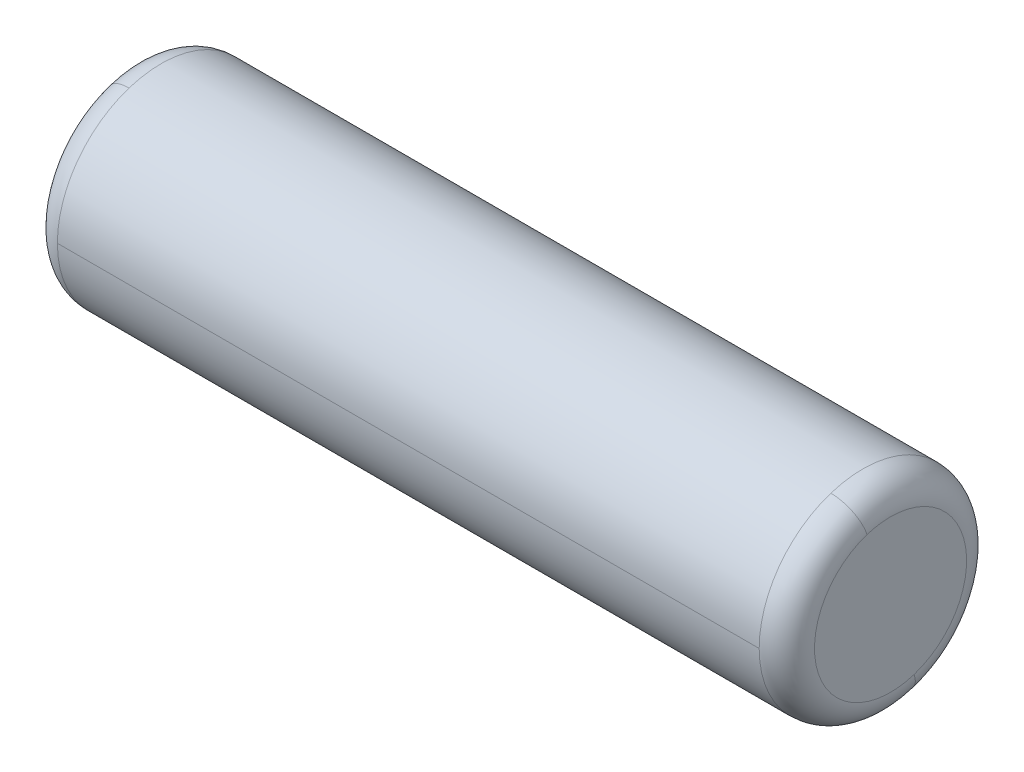
ISO-10303-21;
HEADER;
FILE_DESCRIPTION(('STEP AP214'),'2;1');
FILE_NAME('part.step','',(''),(''),'','','');
FILE_SCHEMA(('AUTOMOTIVE_DESIGN { 1 0 10303 214 1 1 1 1 }'));
ENDSEC;
DATA;
#1=APPLICATION_CONTEXT('core data for automotive mechanical design processes');
#2=APPLICATION_PROTOCOL_DEFINITION('international standard','automotive_design',2000,#1);
#3=PRODUCT_CONTEXT('',#1,'mechanical');
#4=PRODUCT('Part','Part','',(#3));
#5=PRODUCT_RELATED_PRODUCT_CATEGORY('part','',(#4));
#6=PRODUCT_DEFINITION_FORMATION('','',#4);
#7=PRODUCT_DEFINITION_CONTEXT('part definition',#1,'design');
#8=PRODUCT_DEFINITION('design','',#6,#7);
#9=PRODUCT_DEFINITION_SHAPE('','',#8);
#10=(LENGTH_UNIT() NAMED_UNIT(*) SI_UNIT(.MILLI.,.METRE.));
#11=(NAMED_UNIT(*) PLANE_ANGLE_UNIT() SI_UNIT($,.RADIAN.));
#12=(NAMED_UNIT(*) SI_UNIT($,.STERADIAN.) SOLID_ANGLE_UNIT());
#13=UNCERTAINTY_MEASURE_WITH_UNIT(LENGTH_MEASURE(1.E-05),#10,'distance_accuracy_value','');
#14=(GEOMETRIC_REPRESENTATION_CONTEXT(3) GLOBAL_UNCERTAINTY_ASSIGNED_CONTEXT((#13)) GLOBAL_UNIT_ASSIGNED_CONTEXT((#10,
#11,#12)) REPRESENTATION_CONTEXT('',''));
#15=CARTESIAN_POINT('',(0.,0.,0.));
#16=DIRECTION('',(0.,0.,1.));
#17=DIRECTION('',(1.,0.,0.));
#18=AXIS2_PLACEMENT_3D('',#15,#16,#17);
#19=CARTESIAN_POINT('',(2.35,8.,0.));
#20=DIRECTION('',(1.,0.,0.));
#21=DIRECTION('',(0.,0.,-1.));
#22=AXIS2_PLACEMENT_3D('',#19,#20,#21);
#23=PLANE('',#22);
#24=CARTESIAN_POINT('',(2.35,8.69744144528296,0.226612462541579));
#25=CARTESIAN_POINT('',(2.35,8.69373374586507,0.238024411682907));
#26=CARTESIAN_POINT('',(2.35,8.6897454884511,0.249345179232635));
#27=CARTESIAN_POINT('',(2.35,8.68121851156343,0.271777475978529));
#28=CARTESIAN_POINT('',(2.35,8.67667979208974,0.282889005174697));
#29=CARTESIAN_POINT('',(2.35,8.6670625450151,0.304875950043115));
#30=CARTESIAN_POINT('',(2.35,8.66198401741415,0.315751365715366));
#31=CARTESIAN_POINT('',(2.35,8.65129946379298,0.337239912249846));
#32=CARTESIAN_POINT('',(2.35,8.64569343777276,0.347853043112075));
#33=CARTESIAN_POINT('',(2.35,8.6339673726004,0.368791444416637));
#34=CARTESIAN_POINT('',(2.35,8.62784733344826,0.37911671485897));
#35=CARTESIAN_POINT('',(2.35,8.61510799111368,0.399454522892141));
#36=CARTESIAN_POINT('',(2.35,8.60848868793123,0.409467060482979));
#37=CARTESIAN_POINT('',(2.35,8.5947667625726,0.429155281184004));
#38=CARTESIAN_POINT('',(2.35,8.58766414039641,0.438830964294191));
#39=CARTESIAN_POINT('',(2.35,8.57299268827631,0.457822166612945));
#40=CARTESIAN_POINT('',(2.35,8.5654238583324,0.467137685821512));
#41=CARTESIAN_POINT('',(2.35,8.54983822454741,0.485386118395884));
#42=CARTESIAN_POINT('',(2.35,8.54182142070634,0.49431903176169));
#43=CARTESIAN_POINT('',(2.35,8.52535915233747,0.511780732490374));
#44=CARTESIAN_POINT('',(2.35,8.51691368780968,0.520309519853254));
#45=CARTESIAN_POINT('',(2.35,8.4996144439237,0.536942421977464));
#46=CARTESIAN_POINT('',(2.35,8.49076066456552,0.545046536738796));
#47=CARTESIAN_POINT('',(2.35,8.47266612055073,0.560810570138373));
#48=CARTESIAN_POINT('',(2.35,8.46342535589413,0.568470488776618));
#49=CARTESIAN_POINT('',(2.35,8.44457910309343,0.583327676514891));
#50=CARTESIAN_POINT('',(2.35,8.43497361494933,0.590524945614918));
#51=CARTESIAN_POINT('',(2.35,8.41542105563604,0.60443949542514));
#52=CARTESIAN_POINT('',(2.35,8.40547398446686,0.611156776135335));
#53=CARTESIAN_POINT('',(2.35,8.3852622224691,0.624095166648283));
#54=CARTESIAN_POINT('',(2.35,8.37499753164051,0.630316276451037));
#55=CARTESIAN_POINT('',(2.35,8.35417525886322,0.642247337950685));
#56=CARTESIAN_POINT('',(2.35,8.34361767691453,0.64795728964758));
#57=CARTESIAN_POINT('',(2.35,8.32223505603667,0.658852279161742));
#58=CARTESIAN_POINT('',(2.35,8.3114100171075,0.664037316979008));
#59=CARTESIAN_POINT('',(2.35,8.28951856073565,0.673869987523654));
#60=CARTESIAN_POINT('',(2.35,8.27845214329297,0.678517620251034));
#61=CARTESIAN_POINT('',(2.35,8.256104589863,0.687264284061582));
#62=CARTESIAN_POINT('',(2.35,8.24482345387572,0.69136331514475));
#63=CARTESIAN_POINT('',(2.35,8.22207364060126,0.699002900741963));
#64=CARTESIAN_POINT('',(2.35,8.21060496331408,0.702543455256008));
#65=CARTESIAN_POINT('',(2.35,8.18750769648795,0.709057558209035));
#66=CARTESIAN_POINT('',(2.35,8.175879106949,0.712031106648016));
#67=CARTESIAN_POINT('',(2.35,8.15249002991007,0.717404033912273));
#68=CARTESIAN_POINT('',(2.35,8.14072954241009,0.719803412737549));
#69=CARTESIAN_POINT('',(2.35,8.11710500149358,0.724022220460645));
#70=CARTESIAN_POINT('',(2.35,8.10524094807706,0.725841649358465));
#71=CARTESIAN_POINT('',(2.35,8.08143785687131,0.728896174063071));
#72=CARTESIAN_POINT('',(2.35,8.06949881908209,0.730131269869857));
#73=CARTESIAN_POINT('',(2.35,8.04557452131872,0.732014152938414));
#74=CARTESIAN_POINT('',(2.35,8.03358926134458,0.732661940200186));
#75=CARTESIAN_POINT('',(2.35,8.00960139275243,0.733368645602461));
#76=CARTESIAN_POINT('',(2.35,7.99759878413442,0.733427563742966));
#77=CARTESIAN_POINT('',(2.35,7.97360513359,0.732956388963745));
#78=CARTESIAN_POINT('',(2.35,7.9616140916636,0.732426296044021));
#79=CARTESIAN_POINT('',(2.35,7.93767246197268,0.730778376184618));
#80=CARTESIAN_POINT('',(2.35,7.92572187420817,0.72966054924494));
#81=CARTESIAN_POINT('',(2.35,7.90188994285371,0.726839854288637));
#82=CARTESIAN_POINT('',(2.35,7.89000859926377,0.725136986272012));
#83=CARTESIAN_POINT('',(2.35,7.86634377945583,0.721150311520021));
#84=CARTESIAN_POINT('',(2.35,7.85456030323785,0.718866504784656));
#85=CARTESIAN_POINT('',(2.35,7.83111960560015,0.713723454485647));
#86=CARTESIAN_POINT('',(2.35,7.81946238418044,0.710864210922004));
#87=CARTESIAN_POINT('',(2.35,7.79630227940675,0.704577175134626));
#88=CARTESIAN_POINT('',(2.35,7.78479939605277,0.70114938291089));
#89=CARTESIAN_POINT('',(2.35,7.76197567886407,0.693733507655033));
#90=CARTESIAN_POINT('',(2.35,7.75065484502936,0.689745424622912));
#91=CARTESIAN_POINT('',(2.35,7.72822249975948,0.681218575391621));
#92=CARTESIAN_POINT('',(2.35,7.71711098832432,0.676679809192452));
#93=CARTESIAN_POINT('',(2.35,7.69512405645787,0.66706252791239));
#94=CARTESIAN_POINT('',(2.35,7.68424863602657,0.661984012831497));
#95=CARTESIAN_POINT('',(2.35,7.66276008600822,0.651299468375642));
#96=CARTESIAN_POINT('',(2.35,7.65214695642118,0.64569343900068));
#97=CARTESIAN_POINT('',(2.35,7.63120855605011,0.63396737137248));
#98=CARTESIAN_POINT('',(2.35,7.6208832852661,0.627847333119244));
#99=CARTESIAN_POINT('',(2.35,7.60054547698279,0.615107991442699));
#100=CARTESIAN_POINT('',(2.35,7.59053293948351,0.608488688019392));
#101=CARTESIAN_POINT('',(2.35,7.57084471884951,0.594766762484436));
#102=CARTESIAN_POINT('',(2.35,7.56116903571479,0.587664140372787));
#103=CARTESIAN_POINT('',(2.35,7.54217783337808,0.572992688299932));
#104=CARTESIAN_POINT('',(2.35,7.53286231417608,0.565423858338725));
#105=CARTESIAN_POINT('',(2.35,7.51461388160652,0.549838224541081));
#106=CARTESIAN_POINT('',(2.35,7.50568096823896,0.541821420704644));
#107=CARTESIAN_POINT('',(2.35,7.48821926750898,0.52535915233917));
#108=CARTESIAN_POINT('',(2.35,7.47969048014657,0.516913687810134));
#109=CARTESIAN_POINT('',(2.35,7.46305757802271,0.499614443923248));
#110=CARTESIAN_POINT('',(2.35,7.45495346326125,0.490760664565397));
#111=CARTESIAN_POINT('',(2.35,7.43918942986158,0.472666120550857));
#112=CARTESIAN_POINT('',(2.35,7.43152951122337,0.463425355894166));
#113=CARTESIAN_POINT('',(2.35,7.41667232348512,0.444579103093397));
#114=CARTESIAN_POINT('',(2.35,7.40947505438509,0.434973614949318));
#115=CARTESIAN_POINT('',(2.35,7.39556050457486,0.415421055636054));
#116=CARTESIAN_POINT('',(2.35,7.38884322386466,0.405473984466868));
#117=CARTESIAN_POINT('',(2.35,7.37590483335172,0.385262222469097));
#118=CARTESIAN_POINT('',(2.35,7.36968372354896,0.374997531640512));
#119=CARTESIAN_POINT('',(2.35,7.35775266204932,0.354175258863227));
#120=CARTESIAN_POINT('',(2.35,7.35204271035242,0.343617676914528));
#121=CARTESIAN_POINT('',(2.35,7.34114772083826,0.322235056036667));
#122=CARTESIAN_POINT('',(2.35,7.33596268302099,0.311410017107504));
#123=CARTESIAN_POINT('',(2.35,7.32613001247635,0.289518560735656));
#124=CARTESIAN_POINT('',(2.35,7.32148237974896,0.27845214329297));
#125=CARTESIAN_POINT('',(2.35,7.31273571593842,0.256104589863003));
#126=CARTESIAN_POINT('',(2.35,7.30863668485526,0.244823453875721));
#127=CARTESIAN_POINT('',(2.35,7.30099709925803,0.222073640601254));
#128=CARTESIAN_POINT('',(2.35,7.29745654474396,0.210604963314069));
#129=CARTESIAN_POINT('',(2.35,7.290942441791,0.187507696487958));
#130=CARTESIAN_POINT('',(2.35,7.28796889335211,0.175879106949032));
#131=CARTESIAN_POINT('',(2.35,7.2825959660876,0.152490029910033));
#132=CARTESIAN_POINT('',(2.35,7.28019658726198,0.140729542409959));
#133=CARTESIAN_POINT('',(2.35,7.27597777953982,0.117105001493709));
#134=CARTESIAN_POINT('',(2.35,7.27415835064329,0.105240948077533));
#135=CARTESIAN_POINT('',(2.35,7.27110382593518,0.0814378568708378));
#136=CARTESIAN_POINT('',(2.35,7.26986873012361,0.0694988190803187));
#137=CARTESIAN_POINT('',(2.35,7.26798584706812,0.0455745213205006));
#138=CARTESIAN_POINT('',(2.35,7.2673380598242,0.0335892613512017));
#139=CARTESIAN_POINT('',(2.35,7.26663135437315,0.00960139274580662));
#140=CARTESIAN_POINT('',(2.35,7.26657243616601,-0.00240121589028959));
#141=CARTESIAN_POINT('',(2.35,7.26704361112728,-0.026394866385287));
#142=CARTESIAN_POINT('',(2.35,7.26757370429567,-0.0383859082441882));
#143=CARTESIAN_POINT('',(2.35,7.26922162347569,-0.0623275381195325));
#144=CARTESIAN_POINT('',(2.35,7.27033944948731,-0.0742781261359757));
#145=CARTESIAN_POINT('',(2.35,7.27316014697912,-0.0981100568021429));
#146=CARTESIAN_POINT('',(2.35,7.27486301845932,-0.109991399451867));
#147=CARTESIAN_POINT('',(2.35,7.27884968374865,-0.13365622182853));
#148=CARTESIAN_POINT('',(2.35,7.28113347755778,-0.145439701555469));
#149=CARTESIAN_POINT('',(2.35,7.28627656317192,-0.168880389606531));
#150=CARTESIAN_POINT('',(2.35,7.28913585497692,-0.180537597930652));
#151=CARTESIAN_POINT('',(2.35,7.29542275896644,-0.203697738482153));
#152=CARTESIAN_POINT('',(2.35,7.29885037115096,-0.215200670709532));
#153=CARTESIAN_POINT('',(2.35,7.30255855471704,-0.226612462541576));
#154=B_SPLINE_CURVE_WITH_KNOTS('',3,(#24,#25,#26,#27,#28,#29,#30,#31,#32,#33,#34,#35,#36,#37,
#38,#39,#40,#41,#42,#43,#44,#45,#46,#47,#48,#49,#50,#51,#52,#53,#54,#55,#56,#57,#58,#59,#60,#61,
#62,#63,#64,#65,#66,#67,#68,#69,#70,#71,#72,#73,#74,#75,#76,#77,#78,#79,#80,#81,#82,#83,#84,#85,
#86,#87,#88,#89,#90,#91,#92,#93,#94,#95,#96,#97,#98,#99,#100,#101,#102,#103,#104,#105,#106,#107,
#108,#109,#110,#111,#112,#113,#114,#115,#116,#117,#118,#119,#120,#121,#122,#123,#124,#125,#126,
#127,#128,#129,#130,#131,#132,#133,#134,#135,#136,#137,#138,#139,#140,#141,#142,#143,#144,#145,
#146,#147,#148,#149,#150,#151,#152,#153),.UNSPECIFIED.,.F.,.F.,(4,2,2,2,2,2,2,2,2,2,2,2,2,2,2,2,
2,2,2,2,2,2,2,2,2,2,2,2,2,2,2,2,2,2,2,2,2,2,2,2,2,2,2,2,2,2,2,2,2,2,2,2,2,2,2,2,2,2,2,2,2,2,2,2,
4),(0.,0.0359938018335968,0.0719876036671936,0.107981405500791,0.143975207334387,
0.179969009167985,0.215962811001581,0.251956612835178,0.287950414668774,0.323944216502372,
0.359938018335968,0.395931820169565,0.431925622003162,0.467919423836759,0.503913225670357,
0.539907027503953,0.57590082933755,0.611894631171146,0.647888433004743,0.683882234838341,
0.719876036671937,0.755869838505534,0.79186364033913,0.827857442172728,0.863851244006325,
0.899845045839922,0.935838847673518,0.971832649507114,1.00782645134071,1.04382025317431,
1.07981405500791,1.1158078568415,1.1518016586751,1.1877954605087,1.22378926234229,
1.25978306417589,1.29577686600949,1.33177066784308,1.36776446967668,1.40375827151028,
1.43975207334387,1.47574587517747,1.51173967701107,1.54773347884467,1.58372728067826,
1.61972108251186,1.65571488434545,1.69170868617905,1.72770248801265,1.76369628984625,
1.79969009167984,1.83568389351344,1.87167769534704,1.90767149718063,1.94366529901423,
1.97965910084783,2.01565290268142,2.05164670451502,2.08764050634862,2.12363430818221,
2.15962811001581,2.19562191184941,2.231615713683,2.2676095155166,2.3036033173502),.UNSPECIFIED.);
#155=CARTESIAN_POINT('',(2.35,8.69744144528296,0.226612462541579));
#156=VERTEX_POINT('',#155);
#157=CARTESIAN_POINT('',(2.35,7.30255855471704,-0.226612462541579));
#158=VERTEX_POINT('',#157);
#159=EDGE_CURVE('E11',#156,#158,#154,.T.);
#160=ORIENTED_EDGE('',*,*,#159,.F.);
#161=CARTESIAN_POINT('',(2.35,7.30255855471704,-0.226612462541579));
#162=CARTESIAN_POINT('',(2.35,7.30626625413493,-0.238024411682907));
#163=CARTESIAN_POINT('',(2.35,7.3102545115489,-0.249345179232634));
#164=CARTESIAN_POINT('',(2.35,7.31878148843657,-0.271777475978529));
#165=CARTESIAN_POINT('',(2.35,7.32332020791026,-0.282889005174697));
#166=CARTESIAN_POINT('',(2.35,7.3329374549849,-0.304875950043115));
#167=CARTESIAN_POINT('',(2.35,7.33801598258585,-0.315751365715366));
#168=CARTESIAN_POINT('',(2.35,7.34870053620702,-0.337239912249845));
#169=CARTESIAN_POINT('',(2.35,7.35430656222724,-0.347853043112074));
#170=CARTESIAN_POINT('',(2.35,7.3660326273996,-0.368791444416637));
#171=CARTESIAN_POINT('',(2.35,7.37215266655174,-0.37911671485897));
#172=CARTESIAN_POINT('',(2.35,7.38489200888632,-0.399454522892141));
#173=CARTESIAN_POINT('',(2.35,7.39151131206877,-0.409467060482979));
#174=CARTESIAN_POINT('',(2.35,7.4052332374274,-0.429155281184004));
#175=CARTESIAN_POINT('',(2.35,7.41233585960359,-0.438830964294191));
#176=CARTESIAN_POINT('',(2.35,7.42700731172369,-0.457822166612945));
#177=CARTESIAN_POINT('',(2.35,7.43457614166761,-0.467137685821511));
#178=CARTESIAN_POINT('',(2.35,7.45016177545259,-0.485386118395884));
#179=CARTESIAN_POINT('',(2.35,7.45817857929366,-0.49431903176169));
#180=CARTESIAN_POINT('',(2.35,7.47464084766253,-0.511780732490374));
#181=CARTESIAN_POINT('',(2.35,7.48308631219032,-0.520309519853254));
#182=CARTESIAN_POINT('',(2.35,7.5003855560763,-0.536942421977464));
#183=CARTESIAN_POINT('',(2.35,7.50923933543448,-0.545046536738796));
#184=CARTESIAN_POINT('',(2.35,7.52733387944927,-0.560810570138372));
#185=CARTESIAN_POINT('',(2.35,7.53657464410587,-0.568470488776618));
#186=CARTESIAN_POINT('',(2.35,7.55542089690657,-0.583327676514891));
#187=CARTESIAN_POINT('',(2.35,7.56502638505067,-0.590524945614918));
#188=CARTESIAN_POINT('',(2.35,7.58457894436396,-0.60443949542514));
#189=CARTESIAN_POINT('',(2.35,7.59452601553313,-0.611156776135335));
#190=CARTESIAN_POINT('',(2.35,7.6147377775309,-0.624095166648283));
#191=CARTESIAN_POINT('',(2.35,7.62500246835949,-0.630316276451036));
#192=CARTESIAN_POINT('',(2.35,7.64582474113677,-0.642247337950685));
#193=CARTESIAN_POINT('',(2.35,7.65638232308547,-0.64795728964758));
#194=CARTESIAN_POINT('',(2.35,7.67776494396333,-0.658852279161742));
#195=CARTESIAN_POINT('',(2.35,7.6885899828925,-0.664037316979008));
#196=CARTESIAN_POINT('',(2.35,7.71048143926435,-0.673869987523654));
#197=CARTESIAN_POINT('',(2.35,7.72154785670703,-0.678517620251034));
#198=CARTESIAN_POINT('',(2.35,7.743895410137,-0.687264284061582));
#199=CARTESIAN_POINT('',(2.35,7.75517654612428,-0.69136331514475));
#200=CARTESIAN_POINT('',(2.35,7.77792635939874,-0.699002900741963));
#201=CARTESIAN_POINT('',(2.35,7.78939503668592,-0.702543455256008));
#202=CARTESIAN_POINT('',(2.35,7.81249230351205,-0.709057558209034));
#203=CARTESIAN_POINT('',(2.35,7.824120893051,-0.712031106648016));
#204=CARTESIAN_POINT('',(2.35,7.84750997008993,-0.717404033912273));
#205=CARTESIAN_POINT('',(2.35,7.85927045758991,-0.719803412737549));
#206=CARTESIAN_POINT('',(2.35,7.88289499850642,-0.724022220460645));
#207=CARTESIAN_POINT('',(2.35,7.89475905192294,-0.725841649358465));
#208=CARTESIAN_POINT('',(2.35,7.91856214312869,-0.728896174063071));
#209=CARTESIAN_POINT('',(2.35,7.93050118091791,-0.730131269869856));
#210=CARTESIAN_POINT('',(2.35,7.95442547868127,-0.732014152938414));
#211=CARTESIAN_POINT('',(2.35,7.96641073865542,-0.732661940200185));
#212=CARTESIAN_POINT('',(2.35,7.99039860724757,-0.733368645602461));
#213=CARTESIAN_POINT('',(2.35,8.00240121586558,-0.733427563742965));
#214=CARTESIAN_POINT('',(2.35,8.02639486641,-0.732956388963745));
#215=CARTESIAN_POINT('',(2.35,8.0383859083364,-0.732426296044021));
#216=CARTESIAN_POINT('',(2.35,8.06232753802732,-0.730778376184618));
#217=CARTESIAN_POINT('',(2.35,8.07427812579183,-0.72966054924494));
#218=CARTESIAN_POINT('',(2.35,8.09811005714629,-0.726839854288637));
#219=CARTESIAN_POINT('',(2.35,8.10999140073623,-0.725136986272012));
#220=CARTESIAN_POINT('',(2.35,8.13365622054417,-0.721150311520021));
#221=CARTESIAN_POINT('',(2.35,8.14543969676215,-0.718866504784656));
#222=CARTESIAN_POINT('',(2.35,8.16888039439985,-0.713723454485647));
#223=CARTESIAN_POINT('',(2.35,8.18053761581956,-0.710864210922004));
#224=CARTESIAN_POINT('',(2.35,8.20369772059325,-0.704577175134626));
#225=CARTESIAN_POINT('',(2.35,8.21520060394723,-0.701149382910891));
#226=CARTESIAN_POINT('',(2.35,8.23802432113592,-0.693733507655033));
#227=CARTESIAN_POINT('',(2.35,8.24934515497064,-0.689745424622912));
#228=CARTESIAN_POINT('',(2.35,8.27177750024052,-0.681218575391621));
#229=CARTESIAN_POINT('',(2.35,8.28288901167568,-0.676679809192452));
#230=CARTESIAN_POINT('',(2.35,8.30487594354213,-0.66706252791239));
#231=CARTESIAN_POINT('',(2.35,8.31575136397343,-0.661984012831497));
#232=CARTESIAN_POINT('',(2.35,8.33723991399178,-0.651299468375642));
#233=CARTESIAN_POINT('',(2.35,8.34785304357882,-0.64569343900068));
#234=CARTESIAN_POINT('',(2.35,8.36879144394989,-0.63396737137248));
#235=CARTESIAN_POINT('',(2.35,8.3791167147339,-0.627847333119244));
#236=CARTESIAN_POINT('',(2.35,8.39945452301721,-0.615107991442699));
#237=CARTESIAN_POINT('',(2.35,8.40946706051649,-0.608488688019392));
#238=CARTESIAN_POINT('',(2.35,8.42915528115049,-0.594766762484436));
#239=CARTESIAN_POINT('',(2.35,8.43883096428521,-0.587664140372787));
#240=CARTESIAN_POINT('',(2.35,8.45782216662192,-0.572992688299932));
#241=CARTESIAN_POINT('',(2.35,8.46713768582392,-0.565423858338725));
#242=CARTESIAN_POINT('',(2.35,8.48538611839348,-0.549838224541081));
#243=CARTESIAN_POINT('',(2.35,8.49431903176104,-0.541821420704644));
#244=CARTESIAN_POINT('',(2.35,8.51178073249102,-0.525359152339171));
#245=CARTESIAN_POINT('',(2.35,8.52030951985342,-0.516913687810134));
#246=CARTESIAN_POINT('',(2.35,8.53694242197729,-0.499614443923248));
#247=CARTESIAN_POINT('',(2.35,8.54504653673875,-0.490760664565398));
#248=CARTESIAN_POINT('',(2.35,8.56081057013842,-0.472666120550858));
#249=CARTESIAN_POINT('',(2.35,8.56847048877663,-0.463425355894167));
#250=CARTESIAN_POINT('',(2.35,8.58332767651488,-0.444579103093397));
#251=CARTESIAN_POINT('',(2.35,8.59052494561491,-0.434973614949319));
#252=CARTESIAN_POINT('',(2.35,8.60443949542514,-0.415421055636055));
#253=CARTESIAN_POINT('',(2.35,8.61115677613533,-0.405473984466869));
#254=CARTESIAN_POINT('',(2.35,8.62409516664828,-0.385262222469098));
#255=CARTESIAN_POINT('',(2.35,8.63031627645104,-0.374997531640513));
#256=CARTESIAN_POINT('',(2.35,8.64224733795068,-0.354175258863228));
#257=CARTESIAN_POINT('',(2.35,8.64795728964758,-0.343617676914529));
#258=CARTESIAN_POINT('',(2.35,8.65885227916174,-0.322235056036667));
#259=CARTESIAN_POINT('',(2.35,8.66403731697901,-0.311410017107504));
#260=CARTESIAN_POINT('',(2.35,8.67386998752365,-0.289518560735657));
#261=CARTESIAN_POINT('',(2.35,8.67851762025103,-0.278452143292971));
#262=CARTESIAN_POINT('',(2.35,8.68726428406158,-0.256104589863004));
#263=CARTESIAN_POINT('',(2.35,8.69136331514474,-0.244823453875722));
#264=CARTESIAN_POINT('',(2.35,8.69900290074197,-0.222073640601255));
#265=CARTESIAN_POINT('',(2.35,8.70254345525604,-0.21060496331407));
#266=CARTESIAN_POINT('',(2.35,8.709057558209,-0.187507696487959));
#267=CARTESIAN_POINT('',(2.35,8.71203110664789,-0.175879106949033));
#268=CARTESIAN_POINT('',(2.35,8.7174040339124,-0.152490029910034));
#269=CARTESIAN_POINT('',(2.35,8.71980341273802,-0.14072954240996));
#270=CARTESIAN_POINT('',(2.35,8.72402222046017,-0.117105001493711));
#271=CARTESIAN_POINT('',(2.35,8.72584164935671,-0.105240948077534));
#272=CARTESIAN_POINT('',(2.35,8.72889617406482,-0.0814378568708387));
#273=CARTESIAN_POINT('',(2.35,8.73013126987639,-0.0694988190803198));
#274=CARTESIAN_POINT('',(2.35,8.73201415293188,-0.045574521320502));
#275=CARTESIAN_POINT('',(2.35,8.7326619401758,-0.0335892613512031));
#276=CARTESIAN_POINT('',(2.35,8.73336864562685,-0.00960139274580803));
#277=CARTESIAN_POINT('',(2.35,8.73342756383399,0.00240121589028817));
#278=CARTESIAN_POINT('',(2.35,8.73295638887272,0.0263948663852856));
#279=CARTESIAN_POINT('',(2.35,8.73242629570433,0.0383859082441868));
#280=CARTESIAN_POINT('',(2.35,8.73077837652431,0.0623275381195311));
#281=CARTESIAN_POINT('',(2.35,8.72966055051269,0.0742781261359743));
#282=CARTESIAN_POINT('',(2.35,8.72683985302088,0.0981100568021416));
#283=CARTESIAN_POINT('',(2.35,8.72513698154068,0.109991399451866));
#284=CARTESIAN_POINT('',(2.35,8.72115031625135,0.133656221828529));
#285=CARTESIAN_POINT('',(2.35,8.71886652244222,0.145439701555469));
#286=CARTESIAN_POINT('',(2.35,8.71372343682808,0.16888038960653));
#287=CARTESIAN_POINT('',(2.35,8.71086414502308,0.180537597930652));
#288=CARTESIAN_POINT('',(2.35,8.70457724103356,0.203697738482152));
#289=CARTESIAN_POINT('',(2.35,8.70114962884904,0.215200670709531));
#290=CARTESIAN_POINT('',(2.35,8.69744144528296,0.226612462541575));
#291=B_SPLINE_CURVE_WITH_KNOTS('',3,(#161,#162,#163,#164,#165,#166,#167,#168,#169,#170,#171,
#172,#173,#174,#175,#176,#177,#178,#179,#180,#181,#182,#183,#184,#185,#186,#187,#188,#189,#190,
#191,#192,#193,#194,#195,#196,#197,#198,#199,#200,#201,#202,#203,#204,#205,#206,#207,#208,#209,
#210,#211,#212,#213,#214,#215,#216,#217,#218,#219,#220,#221,#222,#223,#224,#225,#226,#227,#228,
#229,#230,#231,#232,#233,#234,#235,#236,#237,#238,#239,#240,#241,#242,#243,#244,#245,#246,#247,
#248,#249,#250,#251,#252,#253,#254,#255,#256,#257,#258,#259,#260,#261,#262,#263,#264,#265,#266,
#267,#268,#269,#270,#271,#272,#273,#274,#275,#276,#277,#278,#279,#280,#281,#282,#283,#284,#285,
#286,#287,#288,#289,#290),.UNSPECIFIED.,.F.,.F.,(4,2,2,2,2,2,2,2,2,2,2,2,2,2,2,2,2,2,2,2,2,2,2,
2,2,2,2,2,2,2,2,2,2,2,2,2,2,2,2,2,2,2,2,2,2,2,2,2,2,2,2,2,2,2,2,2,2,2,2,2,2,2,2,2,4),(0.,
0.0359938018335969,0.0719876036671935,0.10798140550079,0.143975207334387,0.179969009167984,
0.215962811001581,0.251956612835178,0.287950414668775,0.323944216502372,0.359938018335968,
0.395931820169565,0.431925622003162,0.467919423836759,0.503913225670355,0.539907027503952,
0.57590082933755,0.611894631171147,0.647888433004743,0.68388223483834,0.719876036671937,
0.755869838505533,0.79186364033913,0.827857442172728,0.863851244006323,0.89984504583992,
0.935838847673518,0.971832649507114,1.00782645134071,1.04382025317431,1.0798140550079,
1.1158078568415,1.1518016586751,1.18779546050869,1.22378926234229,1.25978306417589,
1.29577686600949,1.33177066784308,1.36776446967668,1.40375827151028,1.43975207334387,
1.47574587517747,1.51173967701107,1.54773347884466,1.58372728067826,1.61972108251186,
1.65571488434545,1.69170868617905,1.72770248801265,1.76369628984624,1.79969009167984,
1.83568389351344,1.87167769534703,1.90767149718063,1.94366529901423,1.97965910084782,
2.01565290268142,2.05164670451502,2.08764050634861,2.12363430818221,2.15962811001581,
2.19562191184941,2.231615713683,2.2676095155166,2.3036033173502),.UNSPECIFIED.);
#292=EDGE_CURVE('E26',#158,#156,#291,.T.);
#293=ORIENTED_EDGE('',*,*,#292,.F.);
#294=EDGE_LOOP('',(#160,#293));
#295=FACE_BOUND('',#294,.T.);
#296=ADVANCED_FACE('F16',(#295),#23,.F.);
#297=CARTESIAN_POINT('',(2.61666666666683,8.,0.));
#298=DIRECTION('',(1.,0.,0.));
#299=DIRECTION('',(0.,-0.309016994374947,0.951056516295154));
#300=AXIS2_PLACEMENT_3D('',#297,#298,#299);
#301=TOROIDAL_SURFACE('',#300,0.733333333333175,0.266666666666826);
#302=CARTESIAN_POINT('',(2.61666666666683,7.30255855471704,-0.226612462541579));
#303=DIRECTION('',(0.,0.309016994374947,-0.951056516295154));
#304=DIRECTION('',(-4.72955008490034E-13,-0.951056516295154,-0.309016994374947));
#305=AXIS2_PLACEMENT_3D('',#302,#303,#304);
#306=CIRCLE('',#305,0.266666666666826);
#307=CARTESIAN_POINT('',(2.6166666666667,7.04894348370485,-0.309016994374947));
#308=VERTEX_POINT('',#307);
#309=EDGE_CURVE('E162',#308,#158,#306,.T.);
#310=ORIENTED_EDGE('',*,*,#309,.T.);
#311=ORIENTED_EDGE('',*,*,#292,.T.);
#312=CARTESIAN_POINT('',(2.61666666666683,8.69744144528296,0.226612462541579));
#313=DIRECTION('',(0.,-0.309016994374948,0.951056516295153));
#314=DIRECTION('',(-4.71289673953099E-13,0.951056516295153,0.309016994374948));
#315=AXIS2_PLACEMENT_3D('',#312,#313,#314);
#316=CIRCLE('',#315,0.266666666666825);
#317=CARTESIAN_POINT('',(2.6166666666667,8.95105651629515,0.309016994374948));
#318=VERTEX_POINT('',#317);
#319=EDGE_CURVE('E157',#318,#156,#316,.T.);
#320=ORIENTED_EDGE('',*,*,#319,.F.);
#321=CARTESIAN_POINT('',(2.6166666666667,8.,0.));
#322=DIRECTION('',(1.,0.,0.));
#323=DIRECTION('',(0.,0.,-1.));
#324=AXIS2_PLACEMENT_3D('',#321,#322,#323);
#325=CIRCLE('',#324,1.);
#326=CARTESIAN_POINT('',(2.6166666666667,8.,-1.));
#327=VERTEX_POINT('',#326);
#328=EDGE_CURVE('E151',#327,#318,#325,.T.);
#329=ORIENTED_EDGE('',*,*,#328,.F.);
#330=CARTESIAN_POINT('',(2.6166666666667,8.,0.));
#331=DIRECTION('',(1.,0.,0.));
#332=DIRECTION('',(0.,0.,-1.));
#333=AXIS2_PLACEMENT_3D('',#330,#331,#332);
#334=CIRCLE('',#333,1.);
#335=EDGE_CURVE('E145',#308,#327,#334,.T.);
#336=ORIENTED_EDGE('',*,*,#335,.F.);
#337=EDGE_LOOP('',(#310,#311,#320,#329,#336));
#338=FACE_BOUND('',#337,.T.);
#339=ADVANCED_FACE('F169',(#338),#301,.T.);
#340=CARTESIAN_POINT('',(9.65,8.,0.));
#341=DIRECTION('',(1.,0.,0.));
#342=DIRECTION('',(0.,1.,0.));
#343=AXIS2_PLACEMENT_3D('',#340,#341,#342);
#344=CYLINDRICAL_SURFACE('',#343,1.);
#345=DIRECTION('',(1.,0.,0.));
#346=VECTOR('',#345,1.);
#347=CARTESIAN_POINT('',(2.6166666666667,8.,1.));
#348=LINE('',#347,#346);
#349=CARTESIAN_POINT('',(2.6166666666667,8.,1.));
#350=VERTEX_POINT('',#349);
#351=CARTESIAN_POINT('',(9.3833333333333,8.,1.));
#352=VERTEX_POINT('',#351);
#353=EDGE_CURVE('E102',#350,#352,#348,.T.);
#354=ORIENTED_EDGE('',*,*,#353,.F.);
#355=CARTESIAN_POINT('',(2.6166666666667,8.,0.));
#356=DIRECTION('',(1.,0.,0.));
#357=DIRECTION('',(0.,0.,-1.));
#358=AXIS2_PLACEMENT_3D('',#355,#356,#357);
#359=CIRCLE('',#358,1.);
#360=EDGE_CURVE('E135',#350,#308,#359,.T.);
#361=ORIENTED_EDGE('',*,*,#360,.T.);
#362=ORIENTED_EDGE('',*,*,#335,.T.);
#363=DIRECTION('',(1.,0.,0.));
#364=VECTOR('',#363,1.);
#365=CARTESIAN_POINT('',(2.6166666666667,8.,-1.));
#366=LINE('',#365,#364);
#367=CARTESIAN_POINT('',(9.3833333333333,8.,-1.));
#368=VERTEX_POINT('',#367);
#369=EDGE_CURVE('E130',#327,#368,#366,.T.);
#370=ORIENTED_EDGE('',*,*,#369,.T.);
#371=CARTESIAN_POINT('',(9.3833333333333,8.,0.));
#372=DIRECTION('',(1.,0.,0.));
#373=DIRECTION('',(0.,0.,-1.));
#374=AXIS2_PLACEMENT_3D('',#371,#372,#373);
#375=CIRCLE('',#374,1.);
#376=CARTESIAN_POINT('',(9.3833333333333,7.04894348370485,-0.309016994374948));
#377=VERTEX_POINT('',#376);
#378=EDGE_CURVE('E94',#377,#368,#375,.T.);
#379=ORIENTED_EDGE('',*,*,#378,.F.);
#380=CARTESIAN_POINT('',(9.3833333333333,8.,0.));
#381=DIRECTION('',(1.,0.,0.));
#382=DIRECTION('',(0.,0.,-1.));
#383=AXIS2_PLACEMENT_3D('',#380,#381,#382);
#384=CIRCLE('',#383,1.);
#385=EDGE_CURVE('E121',#352,#377,#384,.T.);
#386=ORIENTED_EDGE('',*,*,#385,.F.);
#387=EDGE_LOOP('',(#354,#361,#362,#370,#379,#386));
#388=FACE_BOUND('',#387,.T.);
#389=ADVANCED_FACE('F178',(#388),#344,.T.);
#390=CARTESIAN_POINT('',(9.38333333333317,8.,0.));
#391=DIRECTION('',(1.,0.,0.));
#392=DIRECTION('',(0.,0.309016994374947,-0.951056516295154));
#393=AXIS2_PLACEMENT_3D('',#390,#391,#392);
#394=TOROIDAL_SURFACE('',#393,0.733333333333173,0.266666666666828);
#395=CARTESIAN_POINT('',(9.38333333333317,7.30255855471704,-0.226612462541578));
#396=DIRECTION('',(0.,0.309016994374947,-0.951056516295154));
#397=DIRECTION('',(1.,0.,0.));
#398=AXIS2_PLACEMENT_3D('',#395,#396,#397);
#399=CIRCLE('',#398,0.266666666666827);
#400=CARTESIAN_POINT('',(9.65,7.30255855471704,-0.226612462541579));
#401=VERTEX_POINT('',#400);
#402=EDGE_CURVE('E116',#401,#377,#399,.T.);
#403=ORIENTED_EDGE('',*,*,#402,.F.);
#404=CARTESIAN_POINT('',(9.65,8.,0.));
#405=DIRECTION('',(1.,0.,0.));
#406=DIRECTION('',(0.,0.,-1.));
#407=AXIS2_PLACEMENT_3D('',#404,#405,#406);
#408=CIRCLE('',#407,0.733333333333301);
#409=CARTESIAN_POINT('',(9.65,8.69744144528296,0.226612462541579));
#410=VERTEX_POINT('',#409);
#411=EDGE_CURVE('E84',#410,#401,#408,.T.);
#412=ORIENTED_EDGE('',*,*,#411,.F.);
#413=CARTESIAN_POINT('',(9.38333333333317,8.69744144528296,0.226612462541578));
#414=DIRECTION('',(0.,-0.309016994374947,0.951056516295154));
#415=DIRECTION('',(1.,0.,0.));
#416=AXIS2_PLACEMENT_3D('',#413,#414,#415);
#417=CIRCLE('',#416,0.266666666666827);
#418=CARTESIAN_POINT('',(9.3833333333333,8.95105651629515,0.309016994374948));
#419=VERTEX_POINT('',#418);
#420=EDGE_CURVE('E77',#410,#419,#417,.T.);
#421=ORIENTED_EDGE('',*,*,#420,.T.);
#422=CARTESIAN_POINT('',(9.3833333333333,8.,0.));
#423=DIRECTION('',(1.,0.,0.));
#424=DIRECTION('',(0.,0.,-1.));
#425=AXIS2_PLACEMENT_3D('',#422,#423,#424);
#426=CIRCLE('',#425,1.);
#427=EDGE_CURVE('E82',#419,#352,#426,.T.);
#428=ORIENTED_EDGE('',*,*,#427,.T.);
#429=ORIENTED_EDGE('',*,*,#385,.T.);
#430=EDGE_LOOP('',(#403,#412,#421,#428,#429));
#431=FACE_BOUND('',#430,.T.);
#432=ADVANCED_FACE('F79',(#431),#394,.T.);
#433=CARTESIAN_POINT('',(9.65,8.,0.));
#434=DIRECTION('',(1.,0.,0.));
#435=DIRECTION('',(0.,-1.,0.));
#436=AXIS2_PLACEMENT_3D('',#433,#434,#435);
#437=CYLINDRICAL_SURFACE('',#436,1.);
#438=ORIENTED_EDGE('',*,*,#353,.T.);
#439=ORIENTED_EDGE('',*,*,#427,.F.);
#440=CARTESIAN_POINT('',(9.3833333333333,8.,0.));
#441=DIRECTION('',(1.,0.,0.));
#442=DIRECTION('',(0.,0.,-1.));
#443=AXIS2_PLACEMENT_3D('',#440,#441,#442);
#444=CIRCLE('',#443,1.);
#445=EDGE_CURVE('E91',#368,#419,#444,.T.);
#446=ORIENTED_EDGE('',*,*,#445,.F.);
#447=ORIENTED_EDGE('',*,*,#369,.F.);
#448=ORIENTED_EDGE('',*,*,#328,.T.);
#449=CARTESIAN_POINT('',(2.6166666666667,8.,0.));
#450=DIRECTION('',(1.,0.,0.));
#451=DIRECTION('',(0.,0.,-1.));
#452=AXIS2_PLACEMENT_3D('',#449,#450,#451);
#453=CIRCLE('',#452,1.);
#454=EDGE_CURVE('E97',#318,#350,#453,.T.);
#455=ORIENTED_EDGE('',*,*,#454,.T.);
#456=EDGE_LOOP('',(#438,#439,#446,#447,#448,#455));
#457=FACE_BOUND('',#456,.T.);
#458=ADVANCED_FACE('F100',(#457),#437,.T.);
#459=CARTESIAN_POINT('',(2.61666666666683,8.,0.));
#460=DIRECTION('',(1.,0.,0.));
#461=DIRECTION('',(0.,0.309016994374947,-0.951056516295154));
#462=AXIS2_PLACEMENT_3D('',#459,#460,#461);
#463=TOROIDAL_SURFACE('',#462,0.733333333333175,0.266666666666826);
#464=ORIENTED_EDGE('',*,*,#309,.F.);
#465=ORIENTED_EDGE('',*,*,#360,.F.);
#466=ORIENTED_EDGE('',*,*,#454,.F.);
#467=ORIENTED_EDGE('',*,*,#319,.T.);
#468=ORIENTED_EDGE('',*,*,#159,.T.);
#469=EDGE_LOOP('',(#464,#465,#466,#467,#468));
#470=FACE_BOUND('',#469,.T.);
#471=ADVANCED_FACE('F187',(#470),#463,.T.);
#472=CARTESIAN_POINT('',(9.38333333333317,8.,0.));
#473=DIRECTION('',(1.,0.,0.));
#474=DIRECTION('',(0.,-0.309016994374947,0.951056516295154));
#475=AXIS2_PLACEMENT_3D('',#472,#473,#474);
#476=TOROIDAL_SURFACE('',#475,0.733333333333173,0.266666666666828);
#477=ORIENTED_EDGE('',*,*,#402,.T.);
#478=ORIENTED_EDGE('',*,*,#378,.T.);
#479=ORIENTED_EDGE('',*,*,#445,.T.);
#480=ORIENTED_EDGE('',*,*,#420,.F.);
#481=CARTESIAN_POINT('',(9.65,7.30255855471692,-0.226612462541618));
#482=CARTESIAN_POINT('',(9.65,7.37381768910431,-0.445622721072562));
#483=CARTESIAN_POINT('',(9.65,7.53069780879612,-0.637275857189457));
#484=CARTESIAN_POINT('',(9.65,7.76041545463908,-0.754024787079431));
#485=CARTESIAN_POINT('',(9.65,8.25450088851628,-0.783273194783016));
#486=CARTESIAN_POINT('',(9.65,8.63703261849484,-0.469194604486865));
#487=CARTESIAN_POINT('',(9.65,8.75425479867935,-0.239718091712948));
#488=CARTESIAN_POINT('',(9.65,8.76852259462449,0.00754437316359918));
#489=CARTESIAN_POINT('',(9.65,8.69744144528308,0.226612462541617));
#490=B_SPLINE_CURVE_WITH_KNOTS('',5,(#481,#482,#483,#484,#485,#486,#487,#488,#489),
.UNSPECIFIED.,.F.,.F.,(6,3,6),(0.,1.5707963267949,3.14159265358979),.UNSPECIFIED.);
#491=EDGE_CURVE('E209',#401,#410,#490,.T.);
#492=ORIENTED_EDGE('',*,*,#491,.F.);
#493=EDGE_LOOP('',(#477,#478,#479,#480,#492));
#494=FACE_BOUND('',#493,.T.);
#495=ADVANCED_FACE('F93',(#494),#476,.T.);
#496=CARTESIAN_POINT('',(9.65,8.7333333333333,0.));
#497=DIRECTION('',(-1.,0.,0.));
#498=DIRECTION('',(0.,0.,1.));
#499=AXIS2_PLACEMENT_3D('',#496,#497,#498);
#500=PLANE('',#499);
#501=ORIENTED_EDGE('',*,*,#491,.T.);
#502=ORIENTED_EDGE('',*,*,#411,.T.);
#503=EDGE_LOOP('',(#501,#502));
#504=FACE_BOUND('',#503,.T.);
#505=ADVANCED_FACE('F215',(#504),#500,.F.);
#506=CLOSED_SHELL('',(#296,#339,#389,#432,#458,#471,#495,#505));
#507=MANIFOLD_SOLID_BREP('B1',#506);
#508=ADVANCED_BREP_SHAPE_REPRESENTATION('',(#18,#507),#14);
#509=SHAPE_DEFINITION_REPRESENTATION(#9,#508);
ENDSEC;
END-ISO-10303-21;
